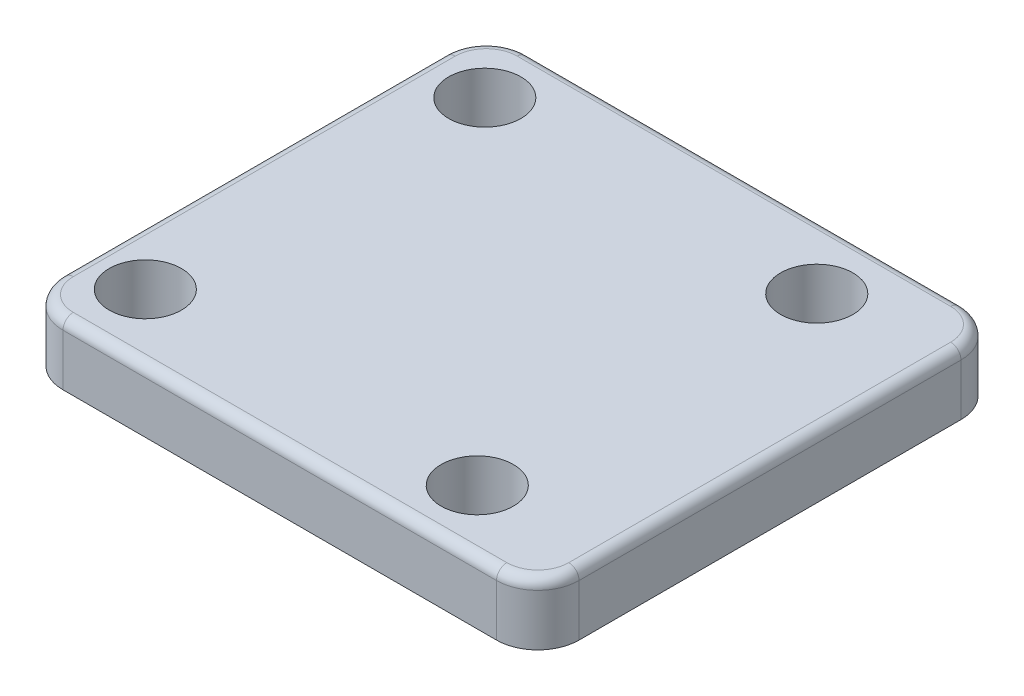
ISO-10303-21;
HEADER;
FILE_DESCRIPTION(('STEP AP214'),'2;1');
FILE_NAME('part.step','',(''),(''),'','','');
FILE_SCHEMA(('AUTOMOTIVE_DESIGN { 1 0 10303 214 1 1 1 1 }'));
ENDSEC;
DATA;
#1=APPLICATION_CONTEXT('core data for automotive mechanical design processes');
#2=APPLICATION_PROTOCOL_DEFINITION('international standard','automotive_design',2000,#1);
#3=PRODUCT_CONTEXT('',#1,'mechanical');
#4=PRODUCT('Part','Part','',(#3));
#5=PRODUCT_RELATED_PRODUCT_CATEGORY('part','',(#4));
#6=PRODUCT_DEFINITION_FORMATION('','',#4);
#7=PRODUCT_DEFINITION_CONTEXT('part definition',#1,'design');
#8=PRODUCT_DEFINITION('design','',#6,#7);
#9=PRODUCT_DEFINITION_SHAPE('','',#8);
#10=(LENGTH_UNIT() NAMED_UNIT(*) SI_UNIT(.MILLI.,.METRE.));
#11=(NAMED_UNIT(*) PLANE_ANGLE_UNIT() SI_UNIT($,.RADIAN.));
#12=(NAMED_UNIT(*) SI_UNIT($,.STERADIAN.) SOLID_ANGLE_UNIT());
#13=UNCERTAINTY_MEASURE_WITH_UNIT(LENGTH_MEASURE(1.E-05),#10,'distance_accuracy_value','');
#14=(GEOMETRIC_REPRESENTATION_CONTEXT(3) GLOBAL_UNCERTAINTY_ASSIGNED_CONTEXT((#13)) GLOBAL_UNIT_ASSIGNED_CONTEXT((#10,
#11,#12)) REPRESENTATION_CONTEXT('',''));
#15=CARTESIAN_POINT('',(0.,0.,0.));
#16=DIRECTION('',(0.,0.,1.));
#17=DIRECTION('',(1.,0.,0.));
#18=AXIS2_PLACEMENT_3D('',#15,#16,#17);
#19=CARTESIAN_POINT('',(-18.,6.,-18.5));
#20=DIRECTION('',(0.,-1.,0.));
#21=DIRECTION('',(0.,0.,-1.));
#22=AXIS2_PLACEMENT_3D('',#19,#20,#21);
#23=CYLINDRICAL_SURFACE('',#22,4.);
#24=DIRECTION('',(0.,-1.,0.));
#25=VECTOR('',#24,1.);
#26=CARTESIAN_POINT('',(-22.,6.,-18.5));
#27=LINE('',#26,#25);
#28=CARTESIAN_POINT('',(-22.,5.,-18.5));
#29=VERTEX_POINT('',#28);
#30=CARTESIAN_POINT('',(-22.,0.,-18.5));
#31=VERTEX_POINT('',#30);
#32=EDGE_CURVE('E135',#29,#31,#27,.T.);
#33=ORIENTED_EDGE('',*,*,#32,.F.);
#34=CARTESIAN_POINT('',(-18.,5.,-18.5));
#35=DIRECTION('',(0.,1.,0.));
#36=DIRECTION('',(0.,0.,1.));
#37=AXIS2_PLACEMENT_3D('',#34,#35,#36);
#38=CIRCLE('',#37,4.);
#39=CARTESIAN_POINT('',(-18.,5.,-22.5));
#40=VERTEX_POINT('',#39);
#41=EDGE_CURVE('E256',#29,#40,#38,.F.);
#42=ORIENTED_EDGE('',*,*,#41,.T.);
#43=DIRECTION('',(0.,-1.,0.));
#44=VECTOR('',#43,1.);
#45=CARTESIAN_POINT('',(-18.,6.,-22.5));
#46=LINE('',#45,#44);
#47=CARTESIAN_POINT('',(-18.,0.,-22.5));
#48=VERTEX_POINT('',#47);
#49=EDGE_CURVE('E163',#40,#48,#46,.T.);
#50=ORIENTED_EDGE('',*,*,#49,.T.);
#51=CARTESIAN_POINT('',(-18.,0.,-18.5));
#52=DIRECTION('',(0.,1.,0.));
#53=DIRECTION('',(0.,0.,1.));
#54=AXIS2_PLACEMENT_3D('',#51,#52,#53);
#55=CIRCLE('',#54,4.);
#56=EDGE_CURVE('E155',#48,#31,#55,.T.);
#57=ORIENTED_EDGE('',*,*,#56,.T.);
#58=EDGE_LOOP('',(#33,#42,#50,#57));
#59=FACE_BOUND('',#58,.T.);
#60=ADVANCED_FACE('F43',(#59),#23,.T.);
#61=CARTESIAN_POINT('',(-22.,6.,0.));
#62=DIRECTION('',(1.,0.,0.));
#63=DIRECTION('',(0.,0.,-1.));
#64=AXIS2_PLACEMENT_3D('',#61,#62,#63);
#65=PLANE('',#64);
#66=DIRECTION('',(0.,-1.,0.));
#67=VECTOR('',#66,1.);
#68=CARTESIAN_POINT('',(-22.,6.,18.5));
#69=LINE('',#68,#67);
#70=CARTESIAN_POINT('',(-22.,5.,18.5));
#71=VERTEX_POINT('',#70);
#72=CARTESIAN_POINT('',(-22.,0.,18.5));
#73=VERTEX_POINT('',#72);
#74=EDGE_CURVE('E148',#71,#73,#69,.T.);
#75=ORIENTED_EDGE('',*,*,#74,.F.);
#76=DIRECTION('',(0.,0.,1.));
#77=VECTOR('',#76,1.);
#78=CARTESIAN_POINT('',(-22.,5.,-18.5));
#79=LINE('',#78,#77);
#80=EDGE_CURVE('E141',#71,#29,#79,.F.);
#81=ORIENTED_EDGE('',*,*,#80,.T.);
#82=ORIENTED_EDGE('',*,*,#32,.T.);
#83=DIRECTION('',(0.,0.,1.));
#84=VECTOR('',#83,1.);
#85=CARTESIAN_POINT('',(-22.,0.,0.));
#86=LINE('',#85,#84);
#87=EDGE_CURVE('E138',#31,#73,#86,.T.);
#88=ORIENTED_EDGE('',*,*,#87,.T.);
#89=EDGE_LOOP('',(#75,#81,#82,#88));
#90=FACE_BOUND('',#89,.T.);
#91=ADVANCED_FACE('F137',(#90),#65,.F.);
#92=CARTESIAN_POINT('',(-18.,6.,18.5));
#93=DIRECTION('',(0.,-1.,0.));
#94=DIRECTION('',(0.,0.,-1.));
#95=AXIS2_PLACEMENT_3D('',#92,#93,#94);
#96=CYLINDRICAL_SURFACE('',#95,4.);
#97=DIRECTION('',(0.,-1.,0.));
#98=VECTOR('',#97,1.);
#99=CARTESIAN_POINT('',(-18.,6.,22.5));
#100=LINE('',#99,#98);
#101=CARTESIAN_POINT('',(-18.,5.,22.5));
#102=VERTEX_POINT('',#101);
#103=CARTESIAN_POINT('',(-18.,0.,22.5));
#104=VERTEX_POINT('',#103);
#105=EDGE_CURVE('E227',#102,#104,#100,.T.);
#106=ORIENTED_EDGE('',*,*,#105,.F.);
#107=CARTESIAN_POINT('',(-18.,5.,18.5));
#108=DIRECTION('',(0.,1.,0.));
#109=DIRECTION('',(0.,0.,1.));
#110=AXIS2_PLACEMENT_3D('',#107,#108,#109);
#111=CIRCLE('',#110,4.);
#112=EDGE_CURVE('E60',#102,#71,#111,.F.);
#113=ORIENTED_EDGE('',*,*,#112,.T.);
#114=ORIENTED_EDGE('',*,*,#74,.T.);
#115=CARTESIAN_POINT('',(-18.,0.,18.5));
#116=DIRECTION('',(0.,1.,0.));
#117=DIRECTION('',(0.,0.,1.));
#118=AXIS2_PLACEMENT_3D('',#115,#116,#117);
#119=CIRCLE('',#118,4.);
#120=EDGE_CURVE('E159',#73,#104,#119,.T.);
#121=ORIENTED_EDGE('',*,*,#120,.T.);
#122=EDGE_LOOP('',(#106,#113,#114,#121));
#123=FACE_BOUND('',#122,.T.);
#124=ADVANCED_FACE('F324',(#123),#96,.T.);
#125=CARTESIAN_POINT('',(0.,6.,22.5));
#126=DIRECTION('',(0.,0.,-1.));
#127=DIRECTION('',(-1.,0.,0.));
#128=AXIS2_PLACEMENT_3D('',#125,#126,#127);
#129=PLANE('',#128);
#130=DIRECTION('',(0.,-1.,0.));
#131=VECTOR('',#130,1.);
#132=CARTESIAN_POINT('',(24.,6.,22.5));
#133=LINE('',#132,#131);
#134=CARTESIAN_POINT('',(24.,5.,22.5));
#135=VERTEX_POINT('',#134);
#136=CARTESIAN_POINT('',(24.,0.,22.5));
#137=VERTEX_POINT('',#136);
#138=EDGE_CURVE('E224',#135,#137,#133,.T.);
#139=ORIENTED_EDGE('',*,*,#138,.F.);
#140=DIRECTION('',(1.,0.,0.));
#141=VECTOR('',#140,1.);
#142=CARTESIAN_POINT('',(-18.,5.,22.5));
#143=LINE('',#142,#141);
#144=EDGE_CURVE('E68',#135,#102,#143,.F.);
#145=ORIENTED_EDGE('',*,*,#144,.T.);
#146=ORIENTED_EDGE('',*,*,#105,.T.);
#147=DIRECTION('',(1.,0.,0.));
#148=VECTOR('',#147,1.);
#149=CARTESIAN_POINT('',(0.,0.,22.5));
#150=LINE('',#149,#148);
#151=EDGE_CURVE('E177',#104,#137,#150,.T.);
#152=ORIENTED_EDGE('',*,*,#151,.T.);
#153=EDGE_LOOP('',(#139,#145,#146,#152));
#154=FACE_BOUND('',#153,.T.);
#155=ADVANCED_FACE('F393',(#154),#129,.F.);
#156=CARTESIAN_POINT('',(24.,6.,18.5));
#157=DIRECTION('',(0.,-1.,0.));
#158=DIRECTION('',(0.,0.,-1.));
#159=AXIS2_PLACEMENT_3D('',#156,#157,#158);
#160=CYLINDRICAL_SURFACE('',#159,4.);
#161=DIRECTION('',(0.,-1.,0.));
#162=VECTOR('',#161,1.);
#163=CARTESIAN_POINT('',(28.,6.,18.5));
#164=LINE('',#163,#162);
#165=CARTESIAN_POINT('',(28.,5.,18.5));
#166=VERTEX_POINT('',#165);
#167=CARTESIAN_POINT('',(28.,0.,18.5));
#168=VERTEX_POINT('',#167);
#169=EDGE_CURVE('E221',#166,#168,#164,.T.);
#170=ORIENTED_EDGE('',*,*,#169,.F.);
#171=CARTESIAN_POINT('',(24.,5.,18.5));
#172=DIRECTION('',(0.,1.,0.));
#173=DIRECTION('',(0.,0.,1.));
#174=AXIS2_PLACEMENT_3D('',#171,#172,#173);
#175=CIRCLE('',#174,4.);
#176=EDGE_CURVE('E268',#166,#135,#175,.F.);
#177=ORIENTED_EDGE('',*,*,#176,.T.);
#178=ORIENTED_EDGE('',*,*,#138,.T.);
#179=CARTESIAN_POINT('',(24.,0.,18.5));
#180=DIRECTION('',(0.,1.,0.));
#181=DIRECTION('',(0.,0.,1.));
#182=AXIS2_PLACEMENT_3D('',#179,#180,#181);
#183=CIRCLE('',#182,4.);
#184=EDGE_CURVE('E181',#137,#168,#183,.T.);
#185=ORIENTED_EDGE('',*,*,#184,.T.);
#186=EDGE_LOOP('',(#170,#177,#178,#185));
#187=FACE_BOUND('',#186,.T.);
#188=ADVANCED_FACE('F392',(#187),#160,.T.);
#189=CARTESIAN_POINT('',(28.,6.,0.));
#190=DIRECTION('',(1.,0.,0.));
#191=DIRECTION('',(0.,0.,-1.));
#192=AXIS2_PLACEMENT_3D('',#189,#190,#191);
#193=PLANE('',#192);
#194=DIRECTION('',(0.,-1.,0.));
#195=VECTOR('',#194,1.);
#196=CARTESIAN_POINT('',(28.,6.,-18.5));
#197=LINE('',#196,#195);
#198=CARTESIAN_POINT('',(28.,5.,-18.5));
#199=VERTEX_POINT('',#198);
#200=CARTESIAN_POINT('',(28.,0.,-18.5));
#201=VERTEX_POINT('',#200);
#202=EDGE_CURVE('E218',#199,#201,#197,.T.);
#203=ORIENTED_EDGE('',*,*,#202,.F.);
#204=DIRECTION('',(0.,0.,1.));
#205=VECTOR('',#204,1.);
#206=CARTESIAN_POINT('',(28.,5.,0.));
#207=LINE('',#206,#205);
#208=EDGE_CURVE('E265',#199,#166,#207,.T.);
#209=ORIENTED_EDGE('',*,*,#208,.T.);
#210=ORIENTED_EDGE('',*,*,#169,.T.);
#211=DIRECTION('',(0.,0.,1.));
#212=VECTOR('',#211,1.);
#213=CARTESIAN_POINT('',(28.,0.,0.));
#214=LINE('',#213,#212);
#215=EDGE_CURVE('E185',#201,#168,#214,.T.);
#216=ORIENTED_EDGE('',*,*,#215,.F.);
#217=EDGE_LOOP('',(#203,#209,#210,#216));
#218=FACE_BOUND('',#217,.T.);
#219=ADVANCED_FACE('F389',(#218),#193,.T.);
#220=CARTESIAN_POINT('',(24.,6.,-18.5));
#221=DIRECTION('',(0.,-1.,0.));
#222=DIRECTION('',(0.,0.,-1.));
#223=AXIS2_PLACEMENT_3D('',#220,#221,#222);
#224=CYLINDRICAL_SURFACE('',#223,4.);
#225=DIRECTION('',(0.,-1.,0.));
#226=VECTOR('',#225,1.);
#227=CARTESIAN_POINT('',(24.,6.,-22.5));
#228=LINE('',#227,#226);
#229=CARTESIAN_POINT('',(24.,5.,-22.5));
#230=VERTEX_POINT('',#229);
#231=CARTESIAN_POINT('',(24.,0.,-22.5));
#232=VERTEX_POINT('',#231);
#233=EDGE_CURVE('E215',#230,#232,#228,.T.);
#234=ORIENTED_EDGE('',*,*,#233,.F.);
#235=CARTESIAN_POINT('',(24.,5.,-18.5));
#236=DIRECTION('',(0.,1.,0.));
#237=DIRECTION('',(0.,0.,1.));
#238=AXIS2_PLACEMENT_3D('',#235,#236,#237);
#239=CIRCLE('',#238,4.);
#240=EDGE_CURVE('E262',#230,#199,#239,.F.);
#241=ORIENTED_EDGE('',*,*,#240,.T.);
#242=ORIENTED_EDGE('',*,*,#202,.T.);
#243=CARTESIAN_POINT('',(24.,0.,-18.5));
#244=DIRECTION('',(0.,1.,0.));
#245=DIRECTION('',(0.,0.,1.));
#246=AXIS2_PLACEMENT_3D('',#243,#244,#245);
#247=CIRCLE('',#246,4.);
#248=EDGE_CURVE('E189',#232,#201,#247,.F.);
#249=ORIENTED_EDGE('',*,*,#248,.F.);
#250=EDGE_LOOP('',(#234,#241,#242,#249));
#251=FACE_BOUND('',#250,.T.);
#252=ADVANCED_FACE('F384',(#251),#224,.T.);
#253=CARTESIAN_POINT('',(16.0797055342492,6.,16.4451533873003));
#254=DIRECTION('',(0.,-1.,0.));
#255=DIRECTION('',(0.,0.,-1.));
#256=AXIS2_PLACEMENT_3D('',#253,#254,#255);
#257=CYLINDRICAL_SURFACE('',#256,3.50000000000016);
#258=CARTESIAN_POINT('',(16.0797055342492,6.,16.4451533873003));
#259=DIRECTION('',(0.,1.,0.));
#260=DIRECTION('',(0.,0.,1.));
#261=AXIS2_PLACEMENT_3D('',#258,#259,#260);
#262=CIRCLE('',#261,3.50000000000016);
#263=CARTESIAN_POINT('',(16.0797055342492,6.,19.9451533873005));
#264=VERTEX_POINT('',#263);
#265=EDGE_CURVE('E585',#264,#264,#262,.T.);
#266=ORIENTED_EDGE('',*,*,#265,.T.);
#267=EDGE_LOOP('',(#266));
#268=FACE_BOUND('',#267,.T.);
#269=CARTESIAN_POINT('',(16.0797055342492,0.,16.4451533873003));
#270=DIRECTION('',(0.,1.,0.));
#271=DIRECTION('',(0.,0.,1.));
#272=AXIS2_PLACEMENT_3D('',#269,#270,#271);
#273=CIRCLE('',#272,3.50000000000016);
#274=CARTESIAN_POINT('',(16.0797055342492,0.,19.9451533873005));
#275=VERTEX_POINT('',#274);
#276=EDGE_CURVE('E204',#275,#275,#273,.T.);
#277=ORIENTED_EDGE('',*,*,#276,.F.);
#278=EDGE_LOOP('',(#277));
#279=FACE_BOUND('',#278,.T.);
#280=ADVANCED_FACE('F406',(#268,#279),#257,.F.);
#281=CARTESIAN_POINT('',(16.4451533873004,6.,-16.0797055342491));
#282=DIRECTION('',(0.,-1.,0.));
#283=DIRECTION('',(0.,0.,-1.));
#284=AXIS2_PLACEMENT_3D('',#281,#282,#283);
#285=CYLINDRICAL_SURFACE('',#284,3.5);
#286=CARTESIAN_POINT('',(16.4451533873004,6.,-16.0797055342491));
#287=DIRECTION('',(0.,1.,0.));
#288=DIRECTION('',(0.,0.,1.));
#289=AXIS2_PLACEMENT_3D('',#286,#287,#288);
#290=CIRCLE('',#289,3.5);
#291=CARTESIAN_POINT('',(16.4451533873004,6.,-12.5797055342491));
#292=VERTEX_POINT('',#291);
#293=EDGE_CURVE('E581',#292,#292,#290,.T.);
#294=ORIENTED_EDGE('',*,*,#293,.T.);
#295=EDGE_LOOP('',(#294));
#296=FACE_BOUND('',#295,.T.);
#297=CARTESIAN_POINT('',(16.4451533873004,0.,-16.0797055342491));
#298=DIRECTION('',(0.,1.,0.));
#299=DIRECTION('',(0.,0.,1.));
#300=AXIS2_PLACEMENT_3D('',#297,#298,#299);
#301=CIRCLE('',#300,3.5);
#302=CARTESIAN_POINT('',(16.4451533873004,0.,-12.5797055342491));
#303=VERTEX_POINT('',#302);
#304=EDGE_CURVE('E200',#303,#303,#301,.T.);
#305=ORIENTED_EDGE('',*,*,#304,.F.);
#306=EDGE_LOOP('',(#305));
#307=FACE_BOUND('',#306,.T.);
#308=ADVANCED_FACE('F413',(#296,#307),#285,.F.);
#309=CARTESIAN_POINT('',(-16.0797055342492,6.,-16.4451533873003));
#310=DIRECTION('',(0.,-1.,0.));
#311=DIRECTION('',(0.,0.,-1.));
#312=AXIS2_PLACEMENT_3D('',#309,#310,#311);
#313=CYLINDRICAL_SURFACE('',#312,3.5);
#314=CARTESIAN_POINT('',(-16.0797055342492,6.,-16.4451533873003));
#315=DIRECTION('',(0.,1.,0.));
#316=DIRECTION('',(0.,0.,1.));
#317=AXIS2_PLACEMENT_3D('',#314,#315,#316);
#318=CIRCLE('',#317,3.5);
#319=CARTESIAN_POINT('',(-16.0797055342492,6.,-12.9451533873003));
#320=VERTEX_POINT('',#319);
#321=EDGE_CURVE('E212',#320,#320,#318,.T.);
#322=ORIENTED_EDGE('',*,*,#321,.T.);
#323=EDGE_LOOP('',(#322));
#324=FACE_BOUND('',#323,.T.);
#325=CARTESIAN_POINT('',(-16.0797055342492,0.,-16.4451533873003));
#326=DIRECTION('',(0.,1.,0.));
#327=DIRECTION('',(0.,0.,1.));
#328=AXIS2_PLACEMENT_3D('',#325,#326,#327);
#329=CIRCLE('',#328,3.5);
#330=CARTESIAN_POINT('',(-16.0797055342492,0.,-12.9451533873003));
#331=VERTEX_POINT('',#330);
#332=EDGE_CURVE('E196',#331,#331,#329,.T.);
#333=ORIENTED_EDGE('',*,*,#332,.F.);
#334=EDGE_LOOP('',(#333));
#335=FACE_BOUND('',#334,.T.);
#336=ADVANCED_FACE('F410',(#324,#335),#313,.F.);
#337=CARTESIAN_POINT('',(0.,6.,-22.5));
#338=DIRECTION('',(0.,0.,-1.));
#339=DIRECTION('',(-1.,0.,0.));
#340=AXIS2_PLACEMENT_3D('',#337,#338,#339);
#341=PLANE('',#340);
#342=ORIENTED_EDGE('',*,*,#49,.F.);
#343=DIRECTION('',(1.,0.,0.));
#344=VECTOR('',#343,1.);
#345=CARTESIAN_POINT('',(0.,5.,-22.5));
#346=LINE('',#345,#344);
#347=EDGE_CURVE('E259',#40,#230,#346,.T.);
#348=ORIENTED_EDGE('',*,*,#347,.T.);
#349=ORIENTED_EDGE('',*,*,#233,.T.);
#350=DIRECTION('',(1.,0.,0.));
#351=VECTOR('',#350,1.);
#352=CARTESIAN_POINT('',(0.,0.,-22.5));
#353=LINE('',#352,#351);
#354=EDGE_CURVE('E193',#48,#232,#353,.T.);
#355=ORIENTED_EDGE('',*,*,#354,.F.);
#356=EDGE_LOOP('',(#342,#348,#349,#355));
#357=FACE_BOUND('',#356,.T.);
#358=ADVANCED_FACE('F378',(#357),#341,.T.);
#359=CARTESIAN_POINT('',(-16.4451533873003,6.,16.0797055342492));
#360=DIRECTION('',(0.,-1.,0.));
#361=DIRECTION('',(0.,0.,-1.));
#362=AXIS2_PLACEMENT_3D('',#359,#360,#361);
#363=CYLINDRICAL_SURFACE('',#362,3.50000000000022);
#364=CARTESIAN_POINT('',(-16.4451533873003,6.,16.0797055342492));
#365=DIRECTION('',(0.,1.,0.));
#366=DIRECTION('',(0.,0.,1.));
#367=AXIS2_PLACEMENT_3D('',#364,#365,#366);
#368=CIRCLE('',#367,3.50000000000022);
#369=CARTESIAN_POINT('',(-16.4451533873003,6.,19.5797055342494));
#370=VERTEX_POINT('',#369);
#371=EDGE_CURVE('E172',#370,#370,#368,.T.);
#372=ORIENTED_EDGE('',*,*,#371,.T.);
#373=EDGE_LOOP('',(#372));
#374=FACE_BOUND('',#373,.T.);
#375=CARTESIAN_POINT('',(-16.4451533873003,0.,16.0797055342492));
#376=DIRECTION('',(0.,1.,0.));
#377=DIRECTION('',(0.,0.,1.));
#378=AXIS2_PLACEMENT_3D('',#375,#376,#377);
#379=CIRCLE('',#378,3.50000000000022);
#380=CARTESIAN_POINT('',(-16.4451533873003,0.,19.5797055342494));
#381=VERTEX_POINT('',#380);
#382=EDGE_CURVE('E208',#381,#381,#379,.T.);
#383=ORIENTED_EDGE('',*,*,#382,.F.);
#384=EDGE_LOOP('',(#383));
#385=FACE_BOUND('',#384,.T.);
#386=ADVANCED_FACE('F409',(#374,#385),#363,.F.);
#387=CARTESIAN_POINT('',(0.,6.,0.));
#388=DIRECTION('',(0.,1.,0.));
#389=DIRECTION('',(0.,0.,1.));
#390=AXIS2_PLACEMENT_3D('',#387,#388,#389);
#391=PLANE('',#390);
#392=DIRECTION('',(1.,0.,0.));
#393=VECTOR('',#392,1.);
#394=CARTESIAN_POINT('',(0.,6.,-21.5));
#395=LINE('',#394,#393);
#396=CARTESIAN_POINT('',(24.,6.,-21.5));
#397=VERTEX_POINT('',#396);
#398=CARTESIAN_POINT('',(-18.,6.,-21.5));
#399=VERTEX_POINT('',#398);
#400=EDGE_CURVE('E249',#397,#399,#395,.F.);
#401=ORIENTED_EDGE('',*,*,#400,.T.);
#402=CARTESIAN_POINT('',(-18.,6.,-18.5));
#403=DIRECTION('',(0.,1.,0.));
#404=DIRECTION('',(0.,0.,1.));
#405=AXIS2_PLACEMENT_3D('',#402,#403,#404);
#406=CIRCLE('',#405,3.);
#407=CARTESIAN_POINT('',(-21.,6.,-18.5));
#408=VERTEX_POINT('',#407);
#409=EDGE_CURVE('E252',#399,#408,#406,.T.);
#410=ORIENTED_EDGE('',*,*,#409,.T.);
#411=DIRECTION('',(0.,0.,1.));
#412=VECTOR('',#411,1.);
#413=CARTESIAN_POINT('',(-21.,6.,18.5));
#414=LINE('',#413,#412);
#415=CARTESIAN_POINT('',(-21.,6.,18.5));
#416=VERTEX_POINT('',#415);
#417=EDGE_CURVE('E147',#408,#416,#414,.T.);
#418=ORIENTED_EDGE('',*,*,#417,.T.);
#419=CARTESIAN_POINT('',(-18.,6.,18.5));
#420=DIRECTION('',(0.,1.,0.));
#421=DIRECTION('',(0.,0.,1.));
#422=AXIS2_PLACEMENT_3D('',#419,#420,#421);
#423=CIRCLE('',#422,3.);
#424=CARTESIAN_POINT('',(-18.,6.,21.5));
#425=VERTEX_POINT('',#424);
#426=EDGE_CURVE('E234',#416,#425,#423,.T.);
#427=ORIENTED_EDGE('',*,*,#426,.T.);
#428=DIRECTION('',(1.,0.,0.));
#429=VECTOR('',#428,1.);
#430=CARTESIAN_POINT('',(24.,6.,21.5));
#431=LINE('',#430,#429);
#432=CARTESIAN_POINT('',(24.,6.,21.5));
#433=VERTEX_POINT('',#432);
#434=EDGE_CURVE('E237',#425,#433,#431,.T.);
#435=ORIENTED_EDGE('',*,*,#434,.T.);
#436=CARTESIAN_POINT('',(24.,6.,18.5));
#437=DIRECTION('',(0.,1.,0.));
#438=DIRECTION('',(0.,0.,1.));
#439=AXIS2_PLACEMENT_3D('',#436,#437,#438);
#440=CIRCLE('',#439,3.);
#441=CARTESIAN_POINT('',(27.,6.,18.5));
#442=VERTEX_POINT('',#441);
#443=EDGE_CURVE('E240',#433,#442,#440,.T.);
#444=ORIENTED_EDGE('',*,*,#443,.T.);
#445=DIRECTION('',(0.,0.,1.));
#446=VECTOR('',#445,1.);
#447=CARTESIAN_POINT('',(27.,6.,0.));
#448=LINE('',#447,#446);
#449=CARTESIAN_POINT('',(27.,6.,-18.5));
#450=VERTEX_POINT('',#449);
#451=EDGE_CURVE('E243',#442,#450,#448,.F.);
#452=ORIENTED_EDGE('',*,*,#451,.T.);
#453=CARTESIAN_POINT('',(24.,6.,-18.5));
#454=DIRECTION('',(0.,1.,0.));
#455=DIRECTION('',(0.,0.,1.));
#456=AXIS2_PLACEMENT_3D('',#453,#454,#455);
#457=CIRCLE('',#456,3.);
#458=EDGE_CURVE('E246',#450,#397,#457,.T.);
#459=ORIENTED_EDGE('',*,*,#458,.T.);
#460=EDGE_LOOP('',(#401,#410,#418,#427,#435,#444,#452,#459));
#461=FACE_BOUND('',#460,.T.);
#462=ORIENTED_EDGE('',*,*,#321,.F.);
#463=EDGE_LOOP('',(#462));
#464=FACE_BOUND('',#463,.T.);
#465=ORIENTED_EDGE('',*,*,#293,.F.);
#466=EDGE_LOOP('',(#465));
#467=FACE_BOUND('',#466,.T.);
#468=ORIENTED_EDGE('',*,*,#265,.F.);
#469=EDGE_LOOP('',(#468));
#470=FACE_BOUND('',#469,.T.);
#471=ORIENTED_EDGE('',*,*,#371,.F.);
#472=EDGE_LOOP('',(#471));
#473=FACE_BOUND('',#472,.T.);
#474=ADVANCED_FACE('F361',(#461,#464,#467,#470,#473),#391,.T.);
#475=CARTESIAN_POINT('',(0.,0.,0.));
#476=DIRECTION('',(0.,1.,0.));
#477=DIRECTION('',(0.,0.,1.));
#478=AXIS2_PLACEMENT_3D('',#475,#476,#477);
#479=PLANE('',#478);
#480=CARTESIAN_POINT('',(0.,0.,0.));
#481=DIRECTION('',(0.,1.,0.));
#482=DIRECTION('',(0.,0.,1.));
#483=AXIS2_PLACEMENT_3D('',#480,#481,#482);
#484=CIRCLE('',#483,16.);
#485=CARTESIAN_POINT('',(0.,0.,16.));
#486=VERTEX_POINT('',#485);
#487=EDGE_CURVE('E277',#486,#486,#484,.F.);
#488=ORIENTED_EDGE('',*,*,#487,.F.);
#489=EDGE_LOOP('',(#488));
#490=FACE_BOUND('',#489,.T.);
#491=ORIENTED_EDGE('',*,*,#56,.F.);
#492=ORIENTED_EDGE('',*,*,#354,.T.);
#493=ORIENTED_EDGE('',*,*,#248,.T.);
#494=ORIENTED_EDGE('',*,*,#215,.T.);
#495=ORIENTED_EDGE('',*,*,#184,.F.);
#496=ORIENTED_EDGE('',*,*,#151,.F.);
#497=ORIENTED_EDGE('',*,*,#120,.F.);
#498=ORIENTED_EDGE('',*,*,#87,.F.);
#499=EDGE_LOOP('',(#491,#492,#493,#494,#495,#496,#497,#498));
#500=FACE_BOUND('',#499,.T.);
#501=ORIENTED_EDGE('',*,*,#332,.T.);
#502=EDGE_LOOP('',(#501));
#503=FACE_BOUND('',#502,.T.);
#504=ORIENTED_EDGE('',*,*,#304,.T.);
#505=EDGE_LOOP('',(#504));
#506=FACE_BOUND('',#505,.T.);
#507=ORIENTED_EDGE('',*,*,#276,.T.);
#508=EDGE_LOOP('',(#507));
#509=FACE_BOUND('',#508,.T.);
#510=ORIENTED_EDGE('',*,*,#382,.T.);
#511=EDGE_LOOP('',(#510));
#512=FACE_BOUND('',#511,.T.);
#513=ADVANCED_FACE('F152',(#490,#500,#503,#506,#509,#512),#479,.F.);
#514=CARTESIAN_POINT('',(24.,5.,18.5));
#515=DIRECTION('',(0.,1.,0.));
#516=DIRECTION('',(0.,0.,1.));
#517=AXIS2_PLACEMENT_3D('',#514,#515,#516);
#518=TOROIDAL_SURFACE('',#517,3.,1.);
#519=CARTESIAN_POINT('',(24.,5.,21.5));
#520=DIRECTION('',(-1.,0.,0.));
#521=DIRECTION('',(0.,0.,1.));
#522=AXIS2_PLACEMENT_3D('',#519,#520,#521);
#523=CIRCLE('',#522,1.);
#524=EDGE_CURVE('E169',#135,#433,#523,.T.);
#525=ORIENTED_EDGE('',*,*,#524,.F.);
#526=ORIENTED_EDGE('',*,*,#176,.F.);
#527=CARTESIAN_POINT('',(27.,5.,18.5));
#528=DIRECTION('',(0.,0.,-1.));
#529=DIRECTION('',(-1.,0.,0.));
#530=AXIS2_PLACEMENT_3D('',#527,#528,#529);
#531=CIRCLE('',#530,1.);
#532=EDGE_CURVE('E165',#442,#166,#531,.T.);
#533=ORIENTED_EDGE('',*,*,#532,.F.);
#534=ORIENTED_EDGE('',*,*,#443,.F.);
#535=EDGE_LOOP('',(#525,#526,#533,#534));
#536=FACE_BOUND('',#535,.T.);
#537=ADVANCED_FACE('F354',(#536),#518,.T.);
#538=CARTESIAN_POINT('',(27.,5.,0.));
#539=DIRECTION('',(0.,0.,1.));
#540=DIRECTION('',(1.,0.,0.));
#541=AXIS2_PLACEMENT_3D('',#538,#539,#540);
#542=CYLINDRICAL_SURFACE('',#541,1.);
#543=ORIENTED_EDGE('',*,*,#532,.T.);
#544=ORIENTED_EDGE('',*,*,#208,.F.);
#545=CARTESIAN_POINT('',(27.,5.,-18.5));
#546=DIRECTION('',(0.,0.,-1.));
#547=DIRECTION('',(-1.,0.,0.));
#548=AXIS2_PLACEMENT_3D('',#545,#546,#547);
#549=CIRCLE('',#548,1.);
#550=EDGE_CURVE('E296',#450,#199,#549,.T.);
#551=ORIENTED_EDGE('',*,*,#550,.F.);
#552=ORIENTED_EDGE('',*,*,#451,.F.);
#553=EDGE_LOOP('',(#543,#544,#551,#552));
#554=FACE_BOUND('',#553,.T.);
#555=ADVANCED_FACE('F351',(#554),#542,.T.);
#556=CARTESIAN_POINT('',(0.,5.,21.5));
#557=DIRECTION('',(-1.,0.,0.));
#558=DIRECTION('',(0.,0.,1.));
#559=AXIS2_PLACEMENT_3D('',#556,#557,#558);
#560=CYLINDRICAL_SURFACE('',#559,1.);
#561=ORIENTED_EDGE('',*,*,#524,.T.);
#562=ORIENTED_EDGE('',*,*,#434,.F.);
#563=CARTESIAN_POINT('',(-18.,5.,21.5));
#564=DIRECTION('',(-1.,0.,0.));
#565=DIRECTION('',(0.,0.,1.));
#566=AXIS2_PLACEMENT_3D('',#563,#564,#565);
#567=CIRCLE('',#566,1.);
#568=EDGE_CURVE('E292',#102,#425,#567,.T.);
#569=ORIENTED_EDGE('',*,*,#568,.F.);
#570=ORIENTED_EDGE('',*,*,#144,.F.);
#571=EDGE_LOOP('',(#561,#562,#569,#570));
#572=FACE_BOUND('',#571,.T.);
#573=ADVANCED_FACE('F347',(#572),#560,.T.);
#574=CARTESIAN_POINT('',(24.,5.,-18.5));
#575=DIRECTION('',(0.,1.,0.));
#576=DIRECTION('',(0.,0.,1.));
#577=AXIS2_PLACEMENT_3D('',#574,#575,#576);
#578=TOROIDAL_SURFACE('',#577,3.,1.);
#579=ORIENTED_EDGE('',*,*,#550,.T.);
#580=ORIENTED_EDGE('',*,*,#240,.F.);
#581=CARTESIAN_POINT('',(24.,5.,-21.5));
#582=DIRECTION('',(-1.,0.,0.));
#583=DIRECTION('',(0.,0.,1.));
#584=AXIS2_PLACEMENT_3D('',#581,#582,#583);
#585=CIRCLE('',#584,1.);
#586=EDGE_CURVE('E288',#397,#230,#585,.T.);
#587=ORIENTED_EDGE('',*,*,#586,.F.);
#588=ORIENTED_EDGE('',*,*,#458,.F.);
#589=EDGE_LOOP('',(#579,#580,#587,#588));
#590=FACE_BOUND('',#589,.T.);
#591=ADVANCED_FACE('F343',(#590),#578,.T.);
#592=CARTESIAN_POINT('',(-18.,5.,18.5));
#593=DIRECTION('',(0.,1.,0.));
#594=DIRECTION('',(0.,0.,1.));
#595=AXIS2_PLACEMENT_3D('',#592,#593,#594);
#596=TOROIDAL_SURFACE('',#595,3.,1.);
#597=ORIENTED_EDGE('',*,*,#568,.T.);
#598=ORIENTED_EDGE('',*,*,#426,.F.);
#599=CARTESIAN_POINT('',(-21.,5.,18.5));
#600=DIRECTION('',(0.,0.,-1.));
#601=DIRECTION('',(-1.,0.,0.));
#602=AXIS2_PLACEMENT_3D('',#599,#600,#601);
#603=CIRCLE('',#602,1.);
#604=EDGE_CURVE('E284',#71,#416,#603,.T.);
#605=ORIENTED_EDGE('',*,*,#604,.F.);
#606=ORIENTED_EDGE('',*,*,#112,.F.);
#607=EDGE_LOOP('',(#597,#598,#605,#606));
#608=FACE_BOUND('',#607,.T.);
#609=ADVANCED_FACE('F339',(#608),#596,.T.);
#610=CARTESIAN_POINT('',(0.,5.,-21.5));
#611=DIRECTION('',(1.,0.,0.));
#612=DIRECTION('',(0.,0.,-1.));
#613=AXIS2_PLACEMENT_3D('',#610,#611,#612);
#614=CYLINDRICAL_SURFACE('',#613,1.);
#615=ORIENTED_EDGE('',*,*,#586,.T.);
#616=ORIENTED_EDGE('',*,*,#347,.F.);
#617=CARTESIAN_POINT('',(-18.,5.,-21.5));
#618=DIRECTION('',(-1.,0.,0.));
#619=DIRECTION('',(0.,0.,1.));
#620=AXIS2_PLACEMENT_3D('',#617,#618,#619);
#621=CIRCLE('',#620,1.);
#622=EDGE_CURVE('E281',#399,#40,#621,.T.);
#623=ORIENTED_EDGE('',*,*,#622,.F.);
#624=ORIENTED_EDGE('',*,*,#400,.F.);
#625=EDGE_LOOP('',(#615,#616,#623,#624));
#626=FACE_BOUND('',#625,.T.);
#627=ADVANCED_FACE('F335',(#626),#614,.T.);
#628=CARTESIAN_POINT('',(-21.,5.,0.));
#629=DIRECTION('',(0.,0.,-1.));
#630=DIRECTION('',(-1.,0.,0.));
#631=AXIS2_PLACEMENT_3D('',#628,#629,#630);
#632=CYLINDRICAL_SURFACE('',#631,1.);
#633=ORIENTED_EDGE('',*,*,#604,.T.);
#634=ORIENTED_EDGE('',*,*,#417,.F.);
#635=CARTESIAN_POINT('',(-21.,5.,-18.5));
#636=DIRECTION('',(0.,0.,-1.));
#637=DIRECTION('',(0.,1.,0.));
#638=AXIS2_PLACEMENT_3D('',#635,#636,#637);
#639=CIRCLE('',#638,1.);
#640=EDGE_CURVE('E278',#29,#408,#639,.T.);
#641=ORIENTED_EDGE('',*,*,#640,.F.);
#642=ORIENTED_EDGE('',*,*,#80,.F.);
#643=EDGE_LOOP('',(#633,#634,#641,#642));
#644=FACE_BOUND('',#643,.T.);
#645=ADVANCED_FACE('F331',(#644),#632,.T.);
#646=CARTESIAN_POINT('',(-18.,5.,-18.5));
#647=DIRECTION('',(0.,1.,0.));
#648=DIRECTION('',(0.,0.,1.));
#649=AXIS2_PLACEMENT_3D('',#646,#647,#648);
#650=TOROIDAL_SURFACE('',#649,3.,1.);
#651=ORIENTED_EDGE('',*,*,#622,.T.);
#652=ORIENTED_EDGE('',*,*,#41,.F.);
#653=ORIENTED_EDGE('',*,*,#640,.T.);
#654=ORIENTED_EDGE('',*,*,#409,.F.);
#655=EDGE_LOOP('',(#651,#652,#653,#654));
#656=FACE_BOUND('',#655,.T.);
#657=ADVANCED_FACE('F328',(#656),#650,.T.);
#658=CARTESIAN_POINT('',(0.,-2.,0.));
#659=DIRECTION('',(0.,1.,0.));
#660=DIRECTION('',(0.,0.,1.));
#661=AXIS2_PLACEMENT_3D('',#658,#659,#660);
#662=CYLINDRICAL_SURFACE('',#661,16.);
#663=CARTESIAN_POINT('',(0.,-0.999999999999999,0.));
#664=DIRECTION('',(0.,-1.,0.));
#665=DIRECTION('',(0.,0.,-1.));
#666=AXIS2_PLACEMENT_3D('',#663,#664,#665);
#667=CIRCLE('',#666,16.);
#668=CARTESIAN_POINT('',(0.,-0.999999999999999,-16.));
#669=VERTEX_POINT('',#668);
#670=EDGE_CURVE('E11',#669,#669,#667,.F.);
#671=ORIENTED_EDGE('',*,*,#670,.T.);
#672=EDGE_LOOP('',(#671));
#673=FACE_BOUND('',#672,.T.);
#674=ORIENTED_EDGE('',*,*,#487,.T.);
#675=EDGE_LOOP('',(#674));
#676=FACE_BOUND('',#675,.T.);
#677=ADVANCED_FACE('F316',(#673,#676),#662,.T.);
#678=CARTESIAN_POINT('',(0.,-2.,0.));
#679=DIRECTION('',(0.,-1.,0.));
#680=DIRECTION('',(0.,0.,-1.));
#681=AXIS2_PLACEMENT_3D('',#678,#679,#680);
#682=PLANE('',#681);
#683=CARTESIAN_POINT('',(0.,-2.,0.));
#684=DIRECTION('',(0.,-1.,0.));
#685=DIRECTION('',(0.,0.,-1.));
#686=AXIS2_PLACEMENT_3D('',#683,#684,#685);
#687=CIRCLE('',#686,15.);
#688=CARTESIAN_POINT('',(0.,-2.,-15.));
#689=VERTEX_POINT('',#688);
#690=EDGE_CURVE('E53',#689,#689,#687,.T.);
#691=ORIENTED_EDGE('',*,*,#690,.T.);
#692=EDGE_LOOP('',(#691));
#693=FACE_BOUND('',#692,.T.);
#694=ADVANCED_FACE('F309',(#693),#682,.T.);
#695=CARTESIAN_POINT('',(0.,-2.,0.));
#696=DIRECTION('',(0.,1.,0.));
#697=DIRECTION('',(0.,0.,1.));
#698=AXIS2_PLACEMENT_3D('',#695,#696,#697);
#699=CONICAL_SURFACE('',#698,15.,0.785398163397448);
#700=ORIENTED_EDGE('',*,*,#670,.F.);
#701=EDGE_LOOP('',(#700));
#702=FACE_BOUND('',#701,.T.);
#703=ORIENTED_EDGE('',*,*,#690,.F.);
#704=EDGE_LOOP('',(#703));
#705=FACE_BOUND('',#704,.T.);
#706=ADVANCED_FACE('F46',(#702,#705),#699,.T.);
#707=CLOSED_SHELL('',(#60,#91,#124,#155,#188,#219,#252,#280,#308,#336,#358,#386,#474,#513,#537,
#555,#573,#591,#609,#627,#645,#657,#677,#694,#706));
#708=MANIFOLD_SOLID_BREP('B2',#707);
#709=ADVANCED_BREP_SHAPE_REPRESENTATION('',(#18,#708),#14);
#710=SHAPE_DEFINITION_REPRESENTATION(#9,#709);
ENDSEC;
END-ISO-10303-21;
